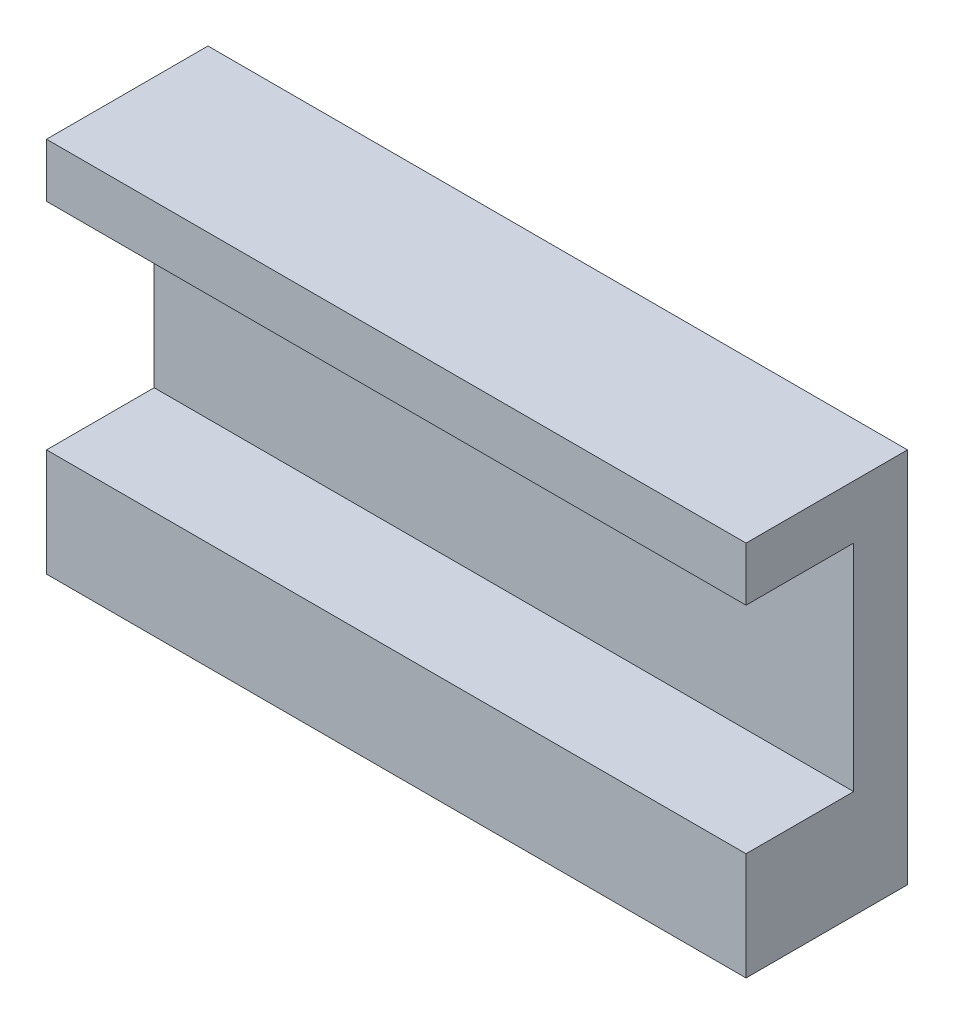
ISO-10303-21;
HEADER;
FILE_DESCRIPTION(('STEP AP214'),'2;1');
FILE_NAME('part.step','',(''),(''),'','','');
FILE_SCHEMA(('AUTOMOTIVE_DESIGN { 1 0 10303 214 1 1 1 1 }'));
ENDSEC;
DATA;
#1=APPLICATION_CONTEXT('core data for automotive mechanical design processes');
#2=APPLICATION_PROTOCOL_DEFINITION('international standard','automotive_design',2000,#1);
#3=PRODUCT_CONTEXT('',#1,'mechanical');
#4=PRODUCT('Part','Part','',(#3));
#5=PRODUCT_RELATED_PRODUCT_CATEGORY('part','',(#4));
#6=PRODUCT_DEFINITION_FORMATION('','',#4);
#7=PRODUCT_DEFINITION_CONTEXT('part definition',#1,'design');
#8=PRODUCT_DEFINITION('design','',#6,#7);
#9=PRODUCT_DEFINITION_SHAPE('','',#8);
#10=(LENGTH_UNIT() NAMED_UNIT(*) SI_UNIT(.MILLI.,.METRE.));
#11=(NAMED_UNIT(*) PLANE_ANGLE_UNIT() SI_UNIT($,.RADIAN.));
#12=(NAMED_UNIT(*) SI_UNIT($,.STERADIAN.) SOLID_ANGLE_UNIT());
#13=UNCERTAINTY_MEASURE_WITH_UNIT(LENGTH_MEASURE(1.E-05),#10,'distance_accuracy_value','');
#14=(GEOMETRIC_REPRESENTATION_CONTEXT(3) GLOBAL_UNCERTAINTY_ASSIGNED_CONTEXT((#13)) GLOBAL_UNIT_ASSIGNED_CONTEXT((#10,
#11,#12)) REPRESENTATION_CONTEXT('',''));
#15=CARTESIAN_POINT('',(0.,0.,0.));
#16=DIRECTION('',(0.,0.,1.));
#17=DIRECTION('',(1.,0.,0.));
#18=AXIS2_PLACEMENT_3D('',#15,#16,#17);
#19=CARTESIAN_POINT('',(0.,0.,10.));
#20=DIRECTION('',(0.,0.,-1.));
#21=DIRECTION('',(-1.,0.,0.));
#22=AXIS2_PLACEMENT_3D('',#19,#20,#21);
#23=PLANE('',#22);
#24=DIRECTION('',(-1.,0.,0.));
#25=VECTOR('',#24,1.);
#26=CARTESIAN_POINT('',(0.,20.,10.));
#27=LINE('',#26,#25);
#28=CARTESIAN_POINT('',(130.,20.,10.));
#29=VERTEX_POINT('',#28);
#30=CARTESIAN_POINT('',(0.,20.,10.));
#31=VERTEX_POINT('',#30);
#32=EDGE_CURVE('E117',#29,#31,#27,.T.);
#33=ORIENTED_EDGE('',*,*,#32,.F.);
#34=DIRECTION('',(0.,1.,0.));
#35=VECTOR('',#34,1.);
#36=CARTESIAN_POINT('',(130.,0.,10.));
#37=LINE('',#36,#35);
#38=CARTESIAN_POINT('',(130.,60.,10.));
#39=VERTEX_POINT('',#38);
#40=EDGE_CURVE('E146',#29,#39,#37,.T.);
#41=ORIENTED_EDGE('',*,*,#40,.T.);
#42=DIRECTION('',(1.,0.,0.));
#43=VECTOR('',#42,1.);
#44=CARTESIAN_POINT('',(130.,60.,10.));
#45=LINE('',#44,#43);
#46=CARTESIAN_POINT('',(0.,60.,10.));
#47=VERTEX_POINT('',#46);
#48=EDGE_CURVE('E53',#47,#39,#45,.T.);
#49=ORIENTED_EDGE('',*,*,#48,.F.);
#50=DIRECTION('',(0.,-1.,0.));
#51=VECTOR('',#50,1.);
#52=CARTESIAN_POINT('',(0.,0.,10.));
#53=LINE('',#52,#51);
#54=EDGE_CURVE('E48',#47,#31,#53,.T.);
#55=ORIENTED_EDGE('',*,*,#54,.T.);
#56=EDGE_LOOP('',(#33,#41,#49,#55));
#57=FACE_BOUND('',#56,.T.);
#58=ADVANCED_FACE('F33',(#57),#23,.F.);
#59=CARTESIAN_POINT('',(0.,0.,10.));
#60=DIRECTION('',(1.,0.,0.));
#61=DIRECTION('',(0.,0.,-1.));
#62=AXIS2_PLACEMENT_3D('',#59,#60,#61);
#63=PLANE('',#62);
#64=DIRECTION('',(0.,-1.,0.));
#65=VECTOR('',#64,1.);
#66=CARTESIAN_POINT('',(0.,0.,0.));
#67=LINE('',#66,#65);
#68=CARTESIAN_POINT('',(0.,70.,0.));
#69=VERTEX_POINT('',#68);
#70=CARTESIAN_POINT('',(0.,0.,0.));
#71=VERTEX_POINT('',#70);
#72=EDGE_CURVE('E103',#69,#71,#67,.T.);
#73=ORIENTED_EDGE('',*,*,#72,.T.);
#74=DIRECTION('',(0.,0.,-1.));
#75=VECTOR('',#74,1.);
#76=CARTESIAN_POINT('',(0.,0.,10.));
#77=LINE('',#76,#75);
#78=CARTESIAN_POINT('',(0.,0.,30.));
#79=VERTEX_POINT('',#78);
#80=EDGE_CURVE('E11',#79,#71,#77,.T.);
#81=ORIENTED_EDGE('',*,*,#80,.F.);
#82=DIRECTION('',(0.,-1.,0.));
#83=VECTOR('',#82,1.);
#84=CARTESIAN_POINT('',(0.,0.,30.));
#85=LINE('',#84,#83);
#86=CARTESIAN_POINT('',(0.,20.,30.));
#87=VERTEX_POINT('',#86);
#88=EDGE_CURVE('E100',#87,#79,#85,.T.);
#89=ORIENTED_EDGE('',*,*,#88,.F.);
#90=DIRECTION('',(0.,0.,-1.));
#91=VECTOR('',#90,1.);
#92=CARTESIAN_POINT('',(0.,20.,30.));
#93=LINE('',#92,#91);
#94=EDGE_CURVE('E122',#87,#31,#93,.T.);
#95=ORIENTED_EDGE('',*,*,#94,.T.);
#96=ORIENTED_EDGE('',*,*,#54,.F.);
#97=DIRECTION('',(0.,0.,-1.));
#98=VECTOR('',#97,1.);
#99=CARTESIAN_POINT('',(0.,60.,30.));
#100=LINE('',#99,#98);
#101=CARTESIAN_POINT('',(0.,60.,30.));
#102=VERTEX_POINT('',#101);
#103=EDGE_CURVE('E142',#102,#47,#100,.T.);
#104=ORIENTED_EDGE('',*,*,#103,.F.);
#105=DIRECTION('',(0.,-1.,0.));
#106=VECTOR('',#105,1.);
#107=CARTESIAN_POINT('',(0.,70.,30.));
#108=LINE('',#107,#106);
#109=CARTESIAN_POINT('',(0.,70.,30.));
#110=VERTEX_POINT('',#109);
#111=EDGE_CURVE('E134',#110,#102,#108,.T.);
#112=ORIENTED_EDGE('',*,*,#111,.F.);
#113=DIRECTION('',(0.,0.,-1.));
#114=VECTOR('',#113,1.);
#115=CARTESIAN_POINT('',(0.,70.,10.));
#116=LINE('',#115,#114);
#117=EDGE_CURVE('E149',#110,#69,#116,.T.);
#118=ORIENTED_EDGE('',*,*,#117,.T.);
#119=EDGE_LOOP('',(#73,#81,#89,#95,#96,#104,#112,#118));
#120=FACE_BOUND('',#119,.T.);
#121=ADVANCED_FACE('F35',(#120),#63,.F.);
#122=CARTESIAN_POINT('',(0.,0.,10.));
#123=DIRECTION('',(0.,1.,0.));
#124=DIRECTION('',(0.,0.,1.));
#125=AXIS2_PLACEMENT_3D('',#122,#123,#124);
#126=PLANE('',#125);
#127=DIRECTION('',(1.,0.,0.));
#128=VECTOR('',#127,1.);
#129=CARTESIAN_POINT('',(0.,0.,0.));
#130=LINE('',#129,#128);
#131=CARTESIAN_POINT('',(130.,0.,0.));
#132=VERTEX_POINT('',#131);
#133=EDGE_CURVE('E151',#71,#132,#130,.T.);
#134=ORIENTED_EDGE('',*,*,#133,.T.);
#135=DIRECTION('',(0.,0.,-1.));
#136=VECTOR('',#135,1.);
#137=CARTESIAN_POINT('',(130.,0.,10.));
#138=LINE('',#137,#136);
#139=CARTESIAN_POINT('',(130.,0.,30.));
#140=VERTEX_POINT('',#139);
#141=EDGE_CURVE('E41',#140,#132,#138,.T.);
#142=ORIENTED_EDGE('',*,*,#141,.F.);
#143=DIRECTION('',(1.,0.,0.));
#144=VECTOR('',#143,1.);
#145=CARTESIAN_POINT('',(0.,0.,30.));
#146=LINE('',#145,#144);
#147=EDGE_CURVE('E106',#79,#140,#146,.T.);
#148=ORIENTED_EDGE('',*,*,#147,.F.);
#149=ORIENTED_EDGE('',*,*,#80,.T.);
#150=EDGE_LOOP('',(#134,#142,#148,#149));
#151=FACE_BOUND('',#150,.T.);
#152=ADVANCED_FACE('F107',(#151),#126,.F.);
#153=CARTESIAN_POINT('',(130.,0.,10.));
#154=DIRECTION('',(-1.,0.,0.));
#155=DIRECTION('',(0.,0.,1.));
#156=AXIS2_PLACEMENT_3D('',#153,#154,#155);
#157=PLANE('',#156);
#158=DIRECTION('',(0.,1.,0.));
#159=VECTOR('',#158,1.);
#160=CARTESIAN_POINT('',(130.,0.,0.));
#161=LINE('',#160,#159);
#162=CARTESIAN_POINT('',(130.,70.,0.));
#163=VERTEX_POINT('',#162);
#164=EDGE_CURVE('E153',#132,#163,#161,.T.);
#165=ORIENTED_EDGE('',*,*,#164,.T.);
#166=DIRECTION('',(0.,0.,-1.));
#167=VECTOR('',#166,1.);
#168=CARTESIAN_POINT('',(130.,70.,10.));
#169=LINE('',#168,#167);
#170=CARTESIAN_POINT('',(130.,70.,30.));
#171=VERTEX_POINT('',#170);
#172=EDGE_CURVE('E157',#171,#163,#169,.T.);
#173=ORIENTED_EDGE('',*,*,#172,.F.);
#174=DIRECTION('',(0.,1.,0.));
#175=VECTOR('',#174,1.);
#176=CARTESIAN_POINT('',(130.,70.,30.));
#177=LINE('',#176,#175);
#178=CARTESIAN_POINT('',(130.,60.,30.));
#179=VERTEX_POINT('',#178);
#180=EDGE_CURVE('E128',#179,#171,#177,.T.);
#181=ORIENTED_EDGE('',*,*,#180,.F.);
#182=DIRECTION('',(0.,0.,-1.));
#183=VECTOR('',#182,1.);
#184=CARTESIAN_POINT('',(130.,60.,30.));
#185=LINE('',#184,#183);
#186=EDGE_CURVE('E138',#179,#39,#185,.T.);
#187=ORIENTED_EDGE('',*,*,#186,.T.);
#188=ORIENTED_EDGE('',*,*,#40,.F.);
#189=DIRECTION('',(0.,0.,-1.));
#190=VECTOR('',#189,1.);
#191=CARTESIAN_POINT('',(130.,20.,30.));
#192=LINE('',#191,#190);
#193=CARTESIAN_POINT('',(130.,20.,30.));
#194=VERTEX_POINT('',#193);
#195=EDGE_CURVE('E125',#194,#29,#192,.T.);
#196=ORIENTED_EDGE('',*,*,#195,.F.);
#197=DIRECTION('',(0.,1.,0.));
#198=VECTOR('',#197,1.);
#199=CARTESIAN_POINT('',(130.,0.,30.));
#200=LINE('',#199,#198);
#201=EDGE_CURVE('E111',#140,#194,#200,.T.);
#202=ORIENTED_EDGE('',*,*,#201,.F.);
#203=ORIENTED_EDGE('',*,*,#141,.T.);
#204=EDGE_LOOP('',(#165,#173,#181,#187,#188,#196,#202,#203));
#205=FACE_BOUND('',#204,.T.);
#206=ADVANCED_FACE('F161',(#205),#157,.F.);
#207=CARTESIAN_POINT('',(0.,70.,10.));
#208=DIRECTION('',(0.,-1.,0.));
#209=DIRECTION('',(0.,0.,-1.));
#210=AXIS2_PLACEMENT_3D('',#207,#208,#209);
#211=PLANE('',#210);
#212=DIRECTION('',(-1.,0.,0.));
#213=VECTOR('',#212,1.);
#214=CARTESIAN_POINT('',(0.,70.,0.));
#215=LINE('',#214,#213);
#216=EDGE_CURVE('E147',#163,#69,#215,.T.);
#217=ORIENTED_EDGE('',*,*,#216,.T.);
#218=ORIENTED_EDGE('',*,*,#117,.F.);
#219=DIRECTION('',(-1.,0.,0.));
#220=VECTOR('',#219,1.);
#221=CARTESIAN_POINT('',(130.,70.,30.));
#222=LINE('',#221,#220);
#223=EDGE_CURVE('E131',#171,#110,#222,.T.);
#224=ORIENTED_EDGE('',*,*,#223,.F.);
#225=ORIENTED_EDGE('',*,*,#172,.T.);
#226=EDGE_LOOP('',(#217,#218,#224,#225));
#227=FACE_BOUND('',#226,.T.);
#228=ADVANCED_FACE('F167',(#227),#211,.F.);
#229=CARTESIAN_POINT('',(0.,0.,0.));
#230=DIRECTION('',(0.,0.,-1.));
#231=DIRECTION('',(-1.,0.,0.));
#232=AXIS2_PLACEMENT_3D('',#229,#230,#231);
#233=PLANE('',#232);
#234=ORIENTED_EDGE('',*,*,#72,.F.);
#235=ORIENTED_EDGE('',*,*,#216,.F.);
#236=ORIENTED_EDGE('',*,*,#164,.F.);
#237=ORIENTED_EDGE('',*,*,#133,.F.);
#238=EDGE_LOOP('',(#234,#235,#236,#237));
#239=FACE_BOUND('',#238,.T.);
#240=ADVANCED_FACE('F165',(#239),#233,.T.);
#241=CARTESIAN_POINT('',(130.,60.,30.));
#242=DIRECTION('',(0.,1.,0.));
#243=DIRECTION('',(-1.,0.,0.));
#244=AXIS2_PLACEMENT_3D('',#241,#242,#243);
#245=PLANE('',#244);
#246=ORIENTED_EDGE('',*,*,#48,.T.);
#247=ORIENTED_EDGE('',*,*,#186,.F.);
#248=DIRECTION('',(1.,0.,0.));
#249=VECTOR('',#248,1.);
#250=CARTESIAN_POINT('',(130.,60.,30.));
#251=LINE('',#250,#249);
#252=EDGE_CURVE('E136',#102,#179,#251,.T.);
#253=ORIENTED_EDGE('',*,*,#252,.F.);
#254=ORIENTED_EDGE('',*,*,#103,.T.);
#255=EDGE_LOOP('',(#246,#247,#253,#254));
#256=FACE_BOUND('',#255,.T.);
#257=ADVANCED_FACE('F177',(#256),#245,.F.);
#258=CARTESIAN_POINT('',(0.,0.,30.));
#259=DIRECTION('',(0.,0.,-1.));
#260=DIRECTION('',(-1.,0.,0.));
#261=AXIS2_PLACEMENT_3D('',#258,#259,#260);
#262=PLANE('',#261);
#263=ORIENTED_EDGE('',*,*,#180,.T.);
#264=ORIENTED_EDGE('',*,*,#223,.T.);
#265=ORIENTED_EDGE('',*,*,#111,.T.);
#266=ORIENTED_EDGE('',*,*,#252,.T.);
#267=EDGE_LOOP('',(#263,#264,#265,#266));
#268=FACE_BOUND('',#267,.T.);
#269=ADVANCED_FACE('F173',(#268),#262,.F.);
#270=CARTESIAN_POINT('',(0.,20.,30.));
#271=DIRECTION('',(0.,-1.,0.));
#272=DIRECTION('',(0.,0.,-1.));
#273=AXIS2_PLACEMENT_3D('',#270,#271,#272);
#274=PLANE('',#273);
#275=ORIENTED_EDGE('',*,*,#32,.T.);
#276=ORIENTED_EDGE('',*,*,#94,.F.);
#277=DIRECTION('',(-1.,0.,0.));
#278=VECTOR('',#277,1.);
#279=CARTESIAN_POINT('',(0.,20.,30.));
#280=LINE('',#279,#278);
#281=EDGE_CURVE('E115',#194,#87,#280,.T.);
#282=ORIENTED_EDGE('',*,*,#281,.F.);
#283=ORIENTED_EDGE('',*,*,#195,.T.);
#284=EDGE_LOOP('',(#275,#276,#282,#283));
#285=FACE_BOUND('',#284,.T.);
#286=ADVANCED_FACE('F184',(#285),#274,.F.);
#287=CARTESIAN_POINT('',(0.,0.,30.));
#288=DIRECTION('',(0.,0.,-1.));
#289=DIRECTION('',(-1.,0.,0.));
#290=AXIS2_PLACEMENT_3D('',#287,#288,#289);
#291=PLANE('',#290);
#292=ORIENTED_EDGE('',*,*,#88,.T.);
#293=ORIENTED_EDGE('',*,*,#147,.T.);
#294=ORIENTED_EDGE('',*,*,#201,.T.);
#295=ORIENTED_EDGE('',*,*,#281,.T.);
#296=EDGE_LOOP('',(#292,#293,#294,#295));
#297=FACE_BOUND('',#296,.T.);
#298=ADVANCED_FACE('F113',(#297),#291,.F.);
#299=CLOSED_SHELL('',(#58,#121,#152,#206,#228,#240,#257,#269,#286,#298));
#300=MANIFOLD_SOLID_BREP('B2',#299);
#301=ADVANCED_BREP_SHAPE_REPRESENTATION('',(#18,#300),#14);
#302=SHAPE_DEFINITION_REPRESENTATION(#9,#301);
ENDSEC;
END-ISO-10303-21;
